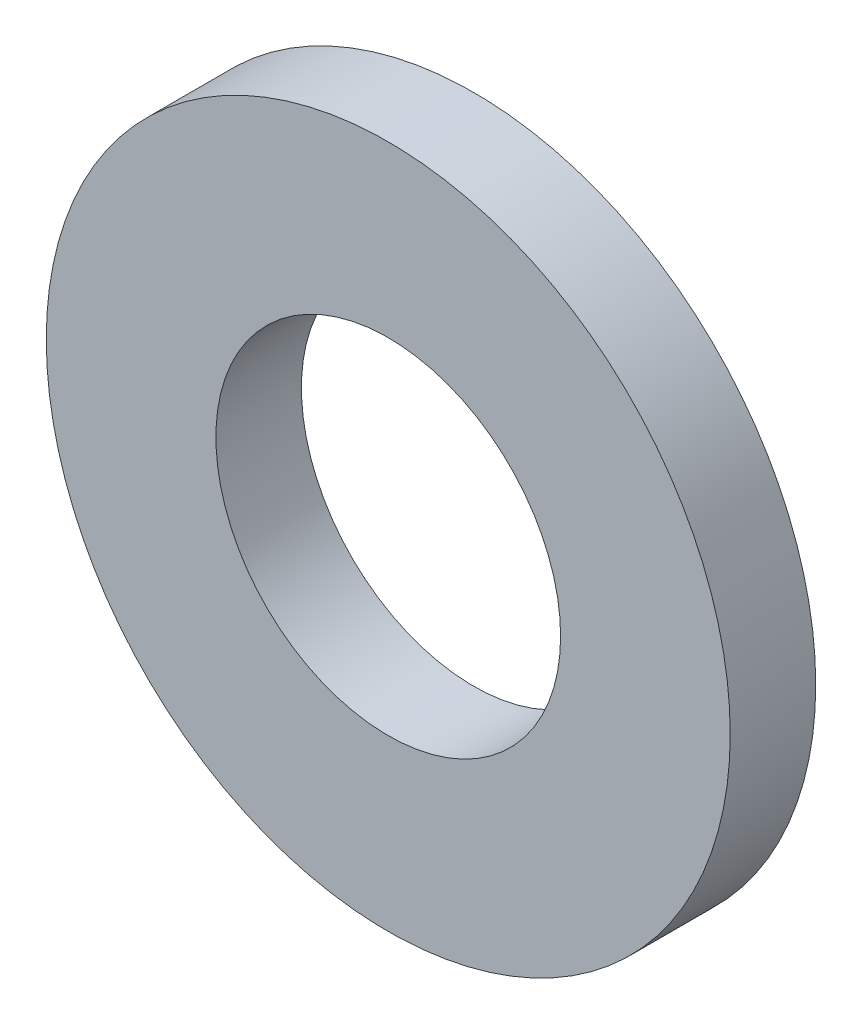
ISO-10303-21;
HEADER;
FILE_DESCRIPTION(('STEP AP214'),'2;1');
FILE_NAME('part.step','',(''),(''),'','','');
FILE_SCHEMA(('AUTOMOTIVE_DESIGN { 1 0 10303 214 1 1 1 1 }'));
ENDSEC;
DATA;
#1=APPLICATION_CONTEXT('core data for automotive mechanical design processes');
#2=APPLICATION_PROTOCOL_DEFINITION('international standard','automotive_design',2000,#1);
#3=PRODUCT_CONTEXT('',#1,'mechanical');
#4=PRODUCT('Part','Part','',(#3));
#5=PRODUCT_RELATED_PRODUCT_CATEGORY('part','',(#4));
#6=PRODUCT_DEFINITION_FORMATION('','',#4);
#7=PRODUCT_DEFINITION_CONTEXT('part definition',#1,'design');
#8=PRODUCT_DEFINITION('design','',#6,#7);
#9=PRODUCT_DEFINITION_SHAPE('','',#8);
#10=(LENGTH_UNIT() NAMED_UNIT(*) SI_UNIT(.MILLI.,.METRE.));
#11=(NAMED_UNIT(*) PLANE_ANGLE_UNIT() SI_UNIT($,.RADIAN.));
#12=(NAMED_UNIT(*) SI_UNIT($,.STERADIAN.) SOLID_ANGLE_UNIT());
#13=UNCERTAINTY_MEASURE_WITH_UNIT(LENGTH_MEASURE(1.E-05),#10,'distance_accuracy_value','');
#14=(GEOMETRIC_REPRESENTATION_CONTEXT(3) GLOBAL_UNCERTAINTY_ASSIGNED_CONTEXT((#13)) GLOBAL_UNIT_ASSIGNED_CONTEXT((#10,
#11,#12)) REPRESENTATION_CONTEXT('',''));
#15=CARTESIAN_POINT('',(0.,0.,0.));
#16=DIRECTION('',(0.,0.,1.));
#17=DIRECTION('',(1.,0.,0.));
#18=AXIS2_PLACEMENT_3D('',#15,#16,#17);
#19=CARTESIAN_POINT('',(0.,0.,3.175));
#20=DIRECTION('',(0.,0.,1.));
#21=DIRECTION('',(1.,0.,0.));
#22=AXIS2_PLACEMENT_3D('',#19,#20,#21);
#23=PLANE('',#22);
#24=CARTESIAN_POINT('',(0.,0.,3.175));
#25=DIRECTION('',(0.,0.,1.));
#26=DIRECTION('',(1.,0.,0.));
#27=AXIS2_PLACEMENT_3D('',#24,#25,#26);
#28=CIRCLE('',#27,12.7);
#29=CARTESIAN_POINT('',(12.7,0.,3.175));
#30=VERTEX_POINT('',#29);
#31=EDGE_CURVE('E10',#30,#30,#28,.T.);
#32=ORIENTED_EDGE('',*,*,#31,.T.);
#33=EDGE_LOOP('',(#32));
#34=FACE_BOUND('',#33,.T.);
#35=CARTESIAN_POINT('',(0.,0.,3.175));
#36=DIRECTION('',(0.,0.,1.));
#37=DIRECTION('',(1.,0.,0.));
#38=AXIS2_PLACEMENT_3D('',#35,#36,#37);
#39=CIRCLE('',#38,6.4008);
#40=CARTESIAN_POINT('',(6.4008,0.,3.175));
#41=VERTEX_POINT('',#40);
#42=EDGE_CURVE('E42',#41,#41,#39,.T.);
#43=ORIENTED_EDGE('',*,*,#42,.F.);
#44=EDGE_LOOP('',(#43));
#45=FACE_BOUND('',#44,.T.);
#46=ADVANCED_FACE('F31',(#34,#45),#23,.T.);
#47=CARTESIAN_POINT('',(0.,0.,0.));
#48=DIRECTION('',(0.,0.,1.));
#49=DIRECTION('',(1.,0.,0.));
#50=AXIS2_PLACEMENT_3D('',#47,#48,#49);
#51=PLANE('',#50);
#52=CARTESIAN_POINT('',(0.,0.,0.));
#53=DIRECTION('',(0.,0.,1.));
#54=DIRECTION('',(1.,0.,0.));
#55=AXIS2_PLACEMENT_3D('',#52,#53,#54);
#56=CIRCLE('',#55,12.7);
#57=CARTESIAN_POINT('',(12.7,0.,0.));
#58=VERTEX_POINT('',#57);
#59=EDGE_CURVE('E35',#58,#58,#56,.T.);
#60=ORIENTED_EDGE('',*,*,#59,.F.);
#61=EDGE_LOOP('',(#60));
#62=FACE_BOUND('',#61,.T.);
#63=CARTESIAN_POINT('',(0.,0.,0.));
#64=DIRECTION('',(0.,0.,1.));
#65=DIRECTION('',(1.,0.,0.));
#66=AXIS2_PLACEMENT_3D('',#63,#64,#65);
#67=CIRCLE('',#66,6.4008);
#68=CARTESIAN_POINT('',(6.4008,0.,0.));
#69=VERTEX_POINT('',#68);
#70=EDGE_CURVE('E44',#69,#69,#67,.T.);
#71=ORIENTED_EDGE('',*,*,#70,.T.);
#72=EDGE_LOOP('',(#71));
#73=FACE_BOUND('',#72,.T.);
#74=ADVANCED_FACE('F54',(#62,#73),#51,.F.);
#75=CARTESIAN_POINT('',(0.,0.,3.175));
#76=DIRECTION('',(0.,0.,-1.));
#77=DIRECTION('',(-1.,0.,0.));
#78=AXIS2_PLACEMENT_3D('',#75,#76,#77);
#79=CYLINDRICAL_SURFACE('',#78,12.7);
#80=ORIENTED_EDGE('',*,*,#31,.F.);
#81=EDGE_LOOP('',(#80));
#82=FACE_BOUND('',#81,.T.);
#83=ORIENTED_EDGE('',*,*,#59,.T.);
#84=EDGE_LOOP('',(#83));
#85=FACE_BOUND('',#84,.T.);
#86=ADVANCED_FACE('F33',(#82,#85),#79,.T.);
#87=CARTESIAN_POINT('',(0.,0.,3.175));
#88=DIRECTION('',(0.,0.,-1.));
#89=DIRECTION('',(-1.,0.,0.));
#90=AXIS2_PLACEMENT_3D('',#87,#88,#89);
#91=CYLINDRICAL_SURFACE('',#90,6.4008);
#92=ORIENTED_EDGE('',*,*,#42,.T.);
#93=EDGE_LOOP('',(#92));
#94=FACE_BOUND('',#93,.T.);
#95=ORIENTED_EDGE('',*,*,#70,.F.);
#96=EDGE_LOOP('',(#95));
#97=FACE_BOUND('',#96,.T.);
#98=ADVANCED_FACE('F50',(#94,#97),#91,.F.);
#99=CLOSED_SHELL('',(#46,#74,#86,#98));
#100=MANIFOLD_SOLID_BREP('B2',#99);
#101=ADVANCED_BREP_SHAPE_REPRESENTATION('',(#18,#100),#14);
#102=SHAPE_DEFINITION_REPRESENTATION(#9,#101);
ENDSEC;
END-ISO-10303-21;
